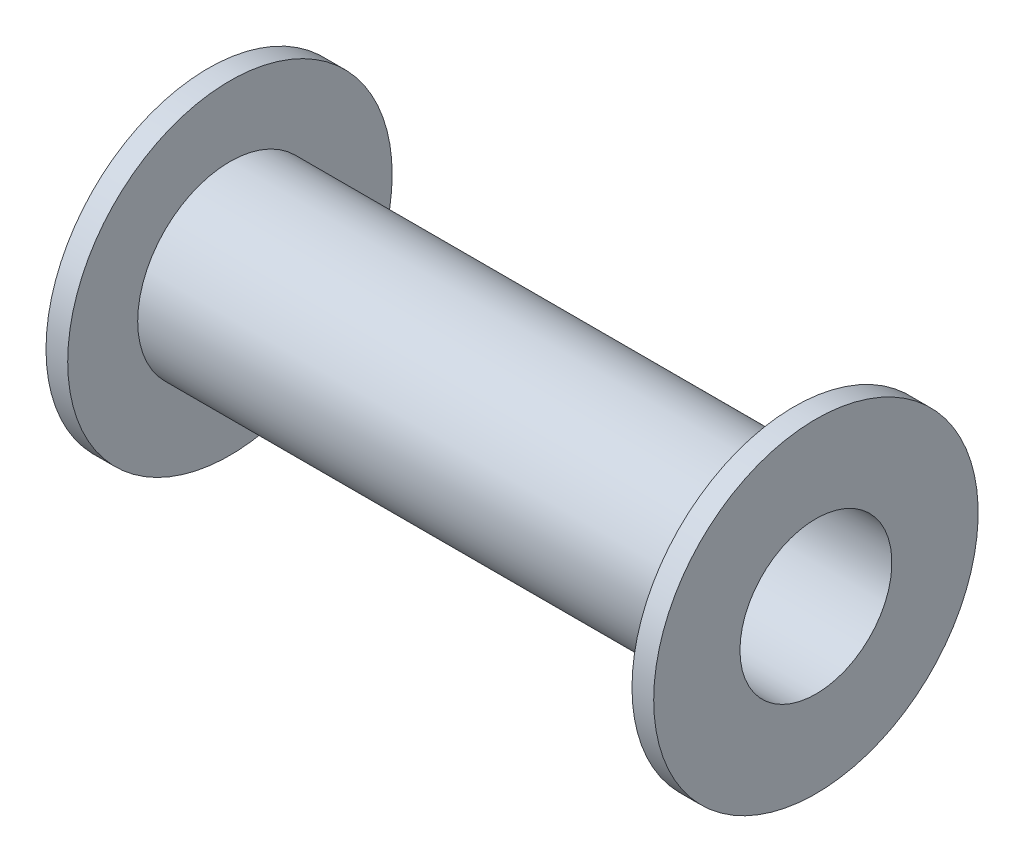
ISO-10303-21;
HEADER;
FILE_DESCRIPTION(('STEP AP214'),'2;1');
FILE_NAME('part.step','',(''),(''),'','','');
FILE_SCHEMA(('AUTOMOTIVE_DESIGN { 1 0 10303 214 1 1 1 1 }'));
ENDSEC;
DATA;
#1=APPLICATION_CONTEXT('core data for automotive mechanical design processes');
#2=APPLICATION_PROTOCOL_DEFINITION('international standard','automotive_design',2000,#1);
#3=PRODUCT_CONTEXT('',#1,'mechanical');
#4=PRODUCT('Part','Part','',(#3));
#5=PRODUCT_RELATED_PRODUCT_CATEGORY('part','',(#4));
#6=PRODUCT_DEFINITION_FORMATION('','',#4);
#7=PRODUCT_DEFINITION_CONTEXT('part definition',#1,'design');
#8=PRODUCT_DEFINITION('design','',#6,#7);
#9=PRODUCT_DEFINITION_SHAPE('','',#8);
#10=(LENGTH_UNIT() NAMED_UNIT(*) SI_UNIT(.MILLI.,.METRE.));
#11=(NAMED_UNIT(*) PLANE_ANGLE_UNIT() SI_UNIT($,.RADIAN.));
#12=(NAMED_UNIT(*) SI_UNIT($,.STERADIAN.) SOLID_ANGLE_UNIT());
#13=UNCERTAINTY_MEASURE_WITH_UNIT(LENGTH_MEASURE(1.E-05),#10,'distance_accuracy_value','');
#14=(GEOMETRIC_REPRESENTATION_CONTEXT(3) GLOBAL_UNCERTAINTY_ASSIGNED_CONTEXT((#13)) GLOBAL_UNIT_ASSIGNED_CONTEXT((#10,
#11,#12)) REPRESENTATION_CONTEXT('',''));
#15=CARTESIAN_POINT('',(0.,0.,0.));
#16=DIRECTION('',(0.,0.,1.));
#17=DIRECTION('',(1.,0.,0.));
#18=AXIS2_PLACEMENT_3D('',#15,#16,#17);
#19=CARTESIAN_POINT('',(-102.95950575681,0.,0.));
#20=DIRECTION('',(-1.,0.,0.));
#21=DIRECTION('',(0.,0.,1.));
#22=AXIS2_PLACEMENT_3D('',#19,#20,#21);
#23=CYLINDRICAL_SURFACE('',#22,14.95);
#24=CARTESIAN_POINT('',(0.,0.,0.));
#25=DIRECTION('',(-1.,0.,0.));
#26=DIRECTION('',(0.,0.,1.));
#27=AXIS2_PLACEMENT_3D('',#24,#25,#26);
#28=CIRCLE('',#27,14.95);
#29=CARTESIAN_POINT('',(0.,0.,14.95));
#30=VERTEX_POINT('',#29);
#31=EDGE_CURVE('E41',#30,#30,#28,.T.);
#32=ORIENTED_EDGE('',*,*,#31,.T.);
#33=EDGE_LOOP('',(#32));
#34=FACE_BOUND('',#33,.T.);
#35=CARTESIAN_POINT('',(-2.,0.,0.));
#36=DIRECTION('',(-1.,0.,0.));
#37=DIRECTION('',(0.,0.,1.));
#38=AXIS2_PLACEMENT_3D('',#35,#36,#37);
#39=CIRCLE('',#38,14.95);
#40=CARTESIAN_POINT('',(-2.,0.,14.95));
#41=VERTEX_POINT('',#40);
#42=EDGE_CURVE('E56',#41,#41,#39,.T.);
#43=ORIENTED_EDGE('',*,*,#42,.F.);
#44=EDGE_LOOP('',(#43));
#45=FACE_BOUND('',#44,.T.);
#46=ADVANCED_FACE('F30',(#34,#45),#23,.T.);
#47=CARTESIAN_POINT('',(-102.95950575681,0.,0.));
#48=DIRECTION('',(-1.,0.,0.));
#49=DIRECTION('',(0.,0.,1.));
#50=AXIS2_PLACEMENT_3D('',#47,#48,#49);
#51=CYLINDRICAL_SURFACE('',#50,14.95);
#52=CARTESIAN_POINT('',(-56.,0.,0.));
#53=DIRECTION('',(-1.,0.,0.));
#54=DIRECTION('',(0.,0.,1.));
#55=AXIS2_PLACEMENT_3D('',#52,#53,#54);
#56=CIRCLE('',#55,14.95);
#57=CARTESIAN_POINT('',(-56.,0.,14.95));
#58=VERTEX_POINT('',#57);
#59=EDGE_CURVE('E37',#58,#58,#56,.T.);
#60=ORIENTED_EDGE('',*,*,#59,.F.);
#61=EDGE_LOOP('',(#60));
#62=FACE_BOUND('',#61,.T.);
#63=CARTESIAN_POINT('',(-54.,0.,0.));
#64=DIRECTION('',(1.,0.,0.));
#65=DIRECTION('',(0.,0.,-1.));
#66=AXIS2_PLACEMENT_3D('',#63,#64,#65);
#67=CIRCLE('',#66,14.95);
#68=CARTESIAN_POINT('',(-54.,0.,-14.95));
#69=VERTEX_POINT('',#68);
#70=EDGE_CURVE('E50',#69,#69,#67,.T.);
#71=ORIENTED_EDGE('',*,*,#70,.F.);
#72=EDGE_LOOP('',(#71));
#73=FACE_BOUND('',#72,.T.);
#74=ADVANCED_FACE('F73',(#62,#73),#51,.T.);
#75=CARTESIAN_POINT('',(-102.95950575681,0.,0.));
#76=DIRECTION('',(-1.,0.,0.));
#77=DIRECTION('',(0.,0.,1.));
#78=AXIS2_PLACEMENT_3D('',#75,#76,#77);
#79=CYLINDRICAL_SURFACE('',#78,7.);
#80=CARTESIAN_POINT('',(-56.,0.,0.));
#81=DIRECTION('',(-1.,0.,0.));
#82=DIRECTION('',(0.,0.,1.));
#83=AXIS2_PLACEMENT_3D('',#80,#81,#82);
#84=CIRCLE('',#83,7.);
#85=CARTESIAN_POINT('',(-56.,0.,7.));
#86=VERTEX_POINT('',#85);
#87=EDGE_CURVE('E10',#86,#86,#84,.T.);
#88=ORIENTED_EDGE('',*,*,#87,.T.);
#89=EDGE_LOOP('',(#88));
#90=FACE_BOUND('',#89,.T.);
#91=CARTESIAN_POINT('',(0.,0.,0.));
#92=DIRECTION('',(-1.,0.,0.));
#93=DIRECTION('',(0.,0.,1.));
#94=AXIS2_PLACEMENT_3D('',#91,#92,#93);
#95=CIRCLE('',#94,7.);
#96=CARTESIAN_POINT('',(0.,0.,7.));
#97=VERTEX_POINT('',#96);
#98=EDGE_CURVE('E45',#97,#97,#95,.T.);
#99=ORIENTED_EDGE('',*,*,#98,.F.);
#100=EDGE_LOOP('',(#99));
#101=FACE_BOUND('',#100,.T.);
#102=ADVANCED_FACE('F32',(#90,#101),#79,.F.);
#103=CARTESIAN_POINT('',(-56.,0.,7.));
#104=DIRECTION('',(-1.,0.,0.));
#105=DIRECTION('',(0.,0.,1.));
#106=AXIS2_PLACEMENT_3D('',#103,#104,#105);
#107=PLANE('',#106);
#108=ORIENTED_EDGE('',*,*,#59,.T.);
#109=EDGE_LOOP('',(#108));
#110=FACE_BOUND('',#109,.T.);
#111=ORIENTED_EDGE('',*,*,#87,.F.);
#112=EDGE_LOOP('',(#111));
#113=FACE_BOUND('',#112,.T.);
#114=ADVANCED_FACE('F86',(#110,#113),#107,.T.);
#115=CARTESIAN_POINT('',(-102.95950575681,0.,0.));
#116=DIRECTION('',(-1.,0.,0.));
#117=DIRECTION('',(0.,0.,1.));
#118=AXIS2_PLACEMENT_3D('',#115,#116,#117);
#119=CYLINDRICAL_SURFACE('',#118,8.5);
#120=CARTESIAN_POINT('',(-54.,0.,0.));
#121=DIRECTION('',(1.,0.,0.));
#122=DIRECTION('',(0.,0.,-1.));
#123=AXIS2_PLACEMENT_3D('',#120,#121,#122);
#124=CIRCLE('',#123,8.5);
#125=CARTESIAN_POINT('',(-54.,0.,-8.5));
#126=VERTEX_POINT('',#125);
#127=EDGE_CURVE('E53',#126,#126,#124,.T.);
#128=ORIENTED_EDGE('',*,*,#127,.T.);
#129=EDGE_LOOP('',(#128));
#130=FACE_BOUND('',#129,.T.);
#131=CARTESIAN_POINT('',(-2.,0.,0.));
#132=DIRECTION('',(-1.,0.,0.));
#133=DIRECTION('',(0.,0.,1.));
#134=AXIS2_PLACEMENT_3D('',#131,#132,#133);
#135=CIRCLE('',#134,8.5);
#136=CARTESIAN_POINT('',(-2.,0.,8.5));
#137=VERTEX_POINT('',#136);
#138=EDGE_CURVE('E59',#137,#137,#135,.T.);
#139=ORIENTED_EDGE('',*,*,#138,.T.);
#140=EDGE_LOOP('',(#139));
#141=FACE_BOUND('',#140,.T.);
#142=ADVANCED_FACE('F63',(#130,#141),#119,.T.);
#143=CARTESIAN_POINT('',(0.,0.,14.95));
#144=DIRECTION('',(1.,0.,0.));
#145=DIRECTION('',(0.,0.,-1.));
#146=AXIS2_PLACEMENT_3D('',#143,#144,#145);
#147=PLANE('',#146);
#148=ORIENTED_EDGE('',*,*,#98,.T.);
#149=EDGE_LOOP('',(#148));
#150=FACE_BOUND('',#149,.T.);
#151=ORIENTED_EDGE('',*,*,#31,.F.);
#152=EDGE_LOOP('',(#151));
#153=FACE_BOUND('',#152,.T.);
#154=ADVANCED_FACE('F83',(#150,#153),#147,.T.);
#155=CARTESIAN_POINT('',(-54.,0.,0.));
#156=DIRECTION('',(1.,0.,0.));
#157=DIRECTION('',(0.,0.,-1.));
#158=AXIS2_PLACEMENT_3D('',#155,#156,#157);
#159=PLANE('',#158);
#160=ORIENTED_EDGE('',*,*,#127,.F.);
#161=EDGE_LOOP('',(#160));
#162=FACE_BOUND('',#161,.T.);
#163=ORIENTED_EDGE('',*,*,#70,.T.);
#164=EDGE_LOOP('',(#163));
#165=FACE_BOUND('',#164,.T.);
#166=ADVANCED_FACE('F68',(#162,#165),#159,.T.);
#167=CARTESIAN_POINT('',(-2.,0.,0.));
#168=DIRECTION('',(-1.,0.,0.));
#169=DIRECTION('',(0.,0.,1.));
#170=AXIS2_PLACEMENT_3D('',#167,#168,#169);
#171=PLANE('',#170);
#172=ORIENTED_EDGE('',*,*,#138,.F.);
#173=EDGE_LOOP('',(#172));
#174=FACE_BOUND('',#173,.T.);
#175=ORIENTED_EDGE('',*,*,#42,.T.);
#176=EDGE_LOOP('',(#175));
#177=FACE_BOUND('',#176,.T.);
#178=ADVANCED_FACE('F65',(#174,#177),#171,.T.);
#179=CLOSED_SHELL('',(#46,#74,#102,#114,#142,#154,#166,#178));
#180=MANIFOLD_SOLID_BREP('B2',#179);
#181=ADVANCED_BREP_SHAPE_REPRESENTATION('',(#18,#180),#14);
#182=SHAPE_DEFINITION_REPRESENTATION(#9,#181);
ENDSEC;
END-ISO-10303-21;
